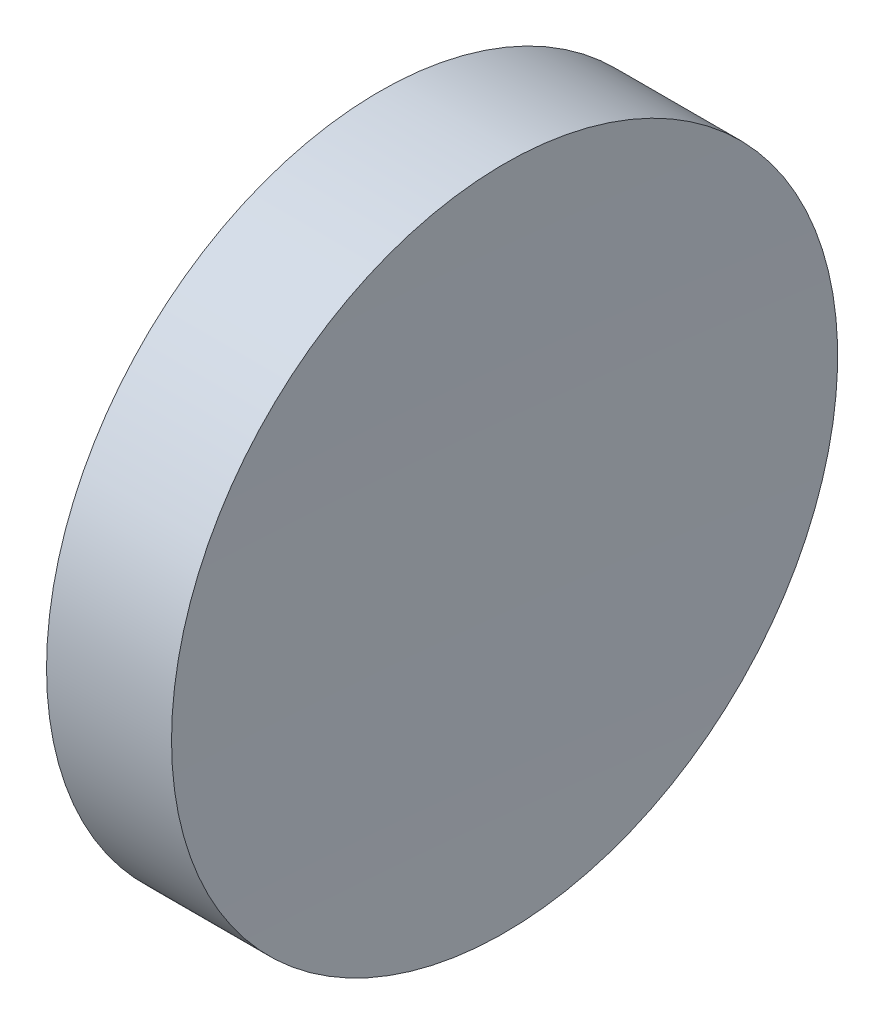
ISO-10303-21;
HEADER;
FILE_DESCRIPTION(('STEP AP214'),'2;1');
FILE_NAME('part.step','',(''),(''),'','','');
FILE_SCHEMA(('AUTOMOTIVE_DESIGN { 1 0 10303 214 1 1 1 1 }'));
ENDSEC;
DATA;
#1=APPLICATION_CONTEXT('core data for automotive mechanical design processes');
#2=APPLICATION_PROTOCOL_DEFINITION('international standard','automotive_design',2000,#1);
#3=PRODUCT_CONTEXT('',#1,'mechanical');
#4=PRODUCT('Part','Part','',(#3));
#5=PRODUCT_RELATED_PRODUCT_CATEGORY('part','',(#4));
#6=PRODUCT_DEFINITION_FORMATION('','',#4);
#7=PRODUCT_DEFINITION_CONTEXT('part definition',#1,'design');
#8=PRODUCT_DEFINITION('design','',#6,#7);
#9=PRODUCT_DEFINITION_SHAPE('','',#8);
#10=(LENGTH_UNIT() NAMED_UNIT(*) SI_UNIT(.MILLI.,.METRE.));
#11=(NAMED_UNIT(*) PLANE_ANGLE_UNIT() SI_UNIT($,.RADIAN.));
#12=(NAMED_UNIT(*) SI_UNIT($,.STERADIAN.) SOLID_ANGLE_UNIT());
#13=UNCERTAINTY_MEASURE_WITH_UNIT(LENGTH_MEASURE(1.E-05),#10,'distance_accuracy_value','');
#14=(GEOMETRIC_REPRESENTATION_CONTEXT(3) GLOBAL_UNCERTAINTY_ASSIGNED_CONTEXT((#13)) GLOBAL_UNIT_ASSIGNED_CONTEXT((#10,
#11,#12)) REPRESENTATION_CONTEXT('',''));
#15=CARTESIAN_POINT('',(0.,0.,0.));
#16=DIRECTION('',(0.,0.,1.));
#17=DIRECTION('',(1.,0.,0.));
#18=AXIS2_PLACEMENT_3D('',#15,#16,#17);
#19=CARTESIAN_POINT('',(0.,0.,0.));
#20=DIRECTION('',(1.,0.,0.));
#21=DIRECTION('',(0.,0.,-1.));
#22=AXIS2_PLACEMENT_3D('',#19,#20,#21);
#23=PLANE('',#22);
#24=CARTESIAN_POINT('',(0.,0.,0.));
#25=DIRECTION('',(-1.,0.,0.));
#26=DIRECTION('',(0.,0.,1.));
#27=AXIS2_PLACEMENT_3D('',#24,#25,#26);
#28=CIRCLE('',#27,25.4);
#29=CARTESIAN_POINT('',(0.,0.,25.4));
#30=VERTEX_POINT('',#29);
#31=EDGE_CURVE('E39',#30,#30,#28,.T.);
#32=ORIENTED_EDGE('',*,*,#31,.T.);
#33=EDGE_LOOP('',(#32));
#34=FACE_BOUND('',#33,.T.);
#35=ADVANCED_FACE('F33',(#34),#23,.F.);
#36=CARTESIAN_POINT('',(1009.21,0.,0.));
#37=DIRECTION('',(-1.,0.,0.));
#38=DIRECTION('',(0.,0.,1.));
#39=AXIS2_PLACEMENT_3D('',#36,#37,#38);
#40=SPHERICAL_SURFACE('',#39,1000.);
#41=CARTESIAN_POINT('',(9.53263204571842,0.,0.));
#42=DIRECTION('',(-1.,0.,0.));
#43=DIRECTION('',(0.,0.,1.));
#44=AXIS2_PLACEMENT_3D('',#41,#42,#43);
#45=CIRCLE('',#44,25.3999999999999);
#46=CARTESIAN_POINT('',(9.53263204571842,0.,25.3999999999999));
#47=VERTEX_POINT('',#46);
#48=EDGE_CURVE('E10',#47,#47,#45,.T.);
#49=ORIENTED_EDGE('',*,*,#48,.F.);
#50=EDGE_LOOP('',(#49));
#51=FACE_BOUND('',#50,.T.);
#52=ADVANCED_FACE('F48',(#51),#40,.F.);
#53=CARTESIAN_POINT('',(0.,0.,0.));
#54=DIRECTION('',(-1.,0.,0.));
#55=DIRECTION('',(0.,0.,1.));
#56=AXIS2_PLACEMENT_3D('',#53,#54,#55);
#57=CYLINDRICAL_SURFACE('',#56,25.3999999999999);
#58=ORIENTED_EDGE('',*,*,#31,.F.);
#59=EDGE_LOOP('',(#58));
#60=FACE_BOUND('',#59,.T.);
#61=ORIENTED_EDGE('',*,*,#48,.T.);
#62=EDGE_LOOP('',(#61));
#63=FACE_BOUND('',#62,.T.);
#64=ADVANCED_FACE('F46',(#60,#63),#57,.T.);
#65=CLOSED_SHELL('',(#35,#52,#64));
#66=MANIFOLD_SOLID_BREP('B2',#65);
#67=ADVANCED_BREP_SHAPE_REPRESENTATION('',(#18,#66),#14);
#68=SHAPE_DEFINITION_REPRESENTATION(#9,#67);
ENDSEC;
END-ISO-10303-21;
